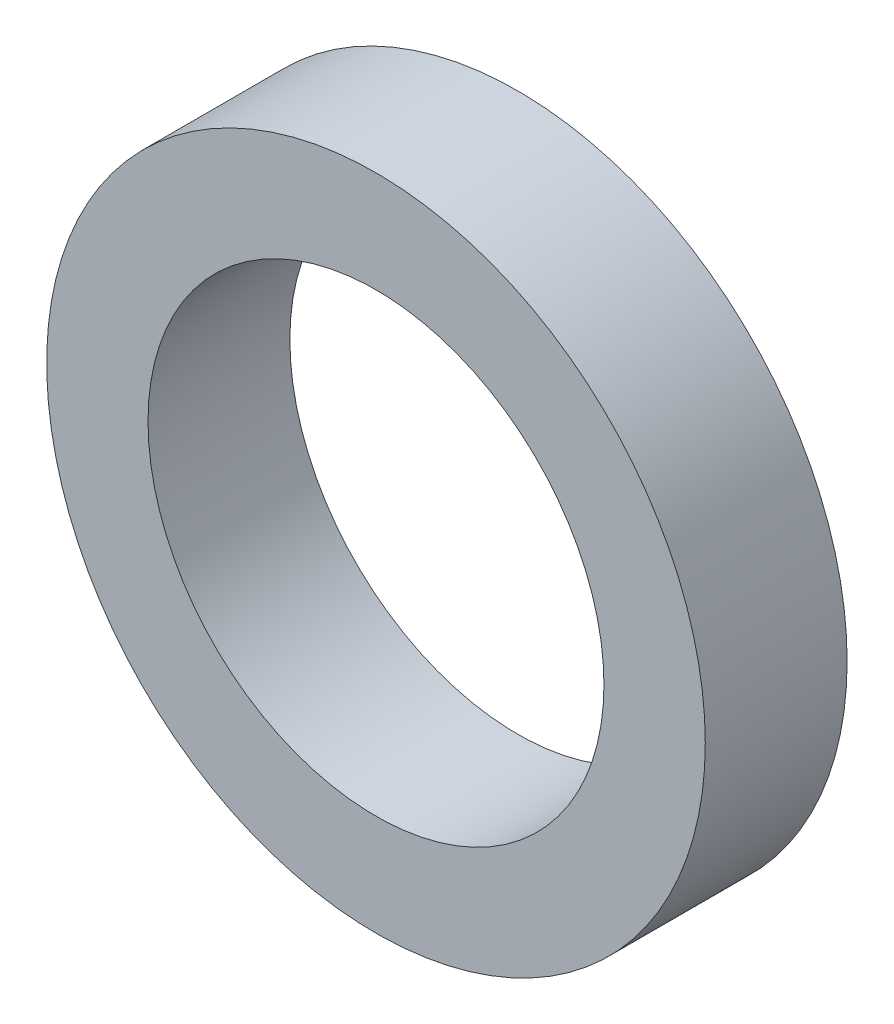
ISO-10303-21;
HEADER;
FILE_DESCRIPTION(('STEP AP214'),'2;1');
FILE_NAME('part.step','',(''),(''),'','','');
FILE_SCHEMA(('AUTOMOTIVE_DESIGN { 1 0 10303 214 1 1 1 1 }'));
ENDSEC;
DATA;
#1=APPLICATION_CONTEXT('core data for automotive mechanical design processes');
#2=APPLICATION_PROTOCOL_DEFINITION('international standard','automotive_design',2000,#1);
#3=PRODUCT_CONTEXT('',#1,'mechanical');
#4=PRODUCT('Part','Part','',(#3));
#5=PRODUCT_RELATED_PRODUCT_CATEGORY('part','',(#4));
#6=PRODUCT_DEFINITION_FORMATION('','',#4);
#7=PRODUCT_DEFINITION_CONTEXT('part definition',#1,'design');
#8=PRODUCT_DEFINITION('design','',#6,#7);
#9=PRODUCT_DEFINITION_SHAPE('','',#8);
#10=(LENGTH_UNIT() NAMED_UNIT(*) SI_UNIT(.MILLI.,.METRE.));
#11=(NAMED_UNIT(*) PLANE_ANGLE_UNIT() SI_UNIT($,.RADIAN.));
#12=(NAMED_UNIT(*) SI_UNIT($,.STERADIAN.) SOLID_ANGLE_UNIT());
#13=UNCERTAINTY_MEASURE_WITH_UNIT(LENGTH_MEASURE(1.E-05),#10,'distance_accuracy_value','');
#14=(GEOMETRIC_REPRESENTATION_CONTEXT(3) GLOBAL_UNCERTAINTY_ASSIGNED_CONTEXT((#13)) GLOBAL_UNIT_ASSIGNED_CONTEXT((#10,
#11,#12)) REPRESENTATION_CONTEXT('',''));
#15=CARTESIAN_POINT('',(0.,0.,0.));
#16=DIRECTION('',(0.,0.,1.));
#17=DIRECTION('',(1.,0.,0.));
#18=AXIS2_PLACEMENT_3D('',#15,#16,#17);
#19=CARTESIAN_POINT('',(0.998101581444755,0.499050790722363,14.));
#20=DIRECTION('',(0.,0.,1.));
#21=DIRECTION('',(1.,0.,0.));
#22=AXIS2_PLACEMENT_3D('',#19,#20,#21);
#23=PLANE('',#22);
#24=CARTESIAN_POINT('',(0.998101581444755,0.499050790722363,14.));
#25=DIRECTION('',(0.,0.,1.));
#26=DIRECTION('',(1.,0.,0.));
#27=AXIS2_PLACEMENT_3D('',#24,#25,#26);
#28=CIRCLE('',#27,32.5);
#29=CARTESIAN_POINT('',(33.4981015814448,0.499050790722363,14.));
#30=VERTEX_POINT('',#29);
#31=EDGE_CURVE('E10',#30,#30,#28,.T.);
#32=ORIENTED_EDGE('',*,*,#31,.T.);
#33=EDGE_LOOP('',(#32));
#34=FACE_BOUND('',#33,.T.);
#35=CARTESIAN_POINT('',(0.998101581444755,0.499050790722363,14.));
#36=DIRECTION('',(0.,0.,1.));
#37=DIRECTION('',(1.,0.,0.));
#38=AXIS2_PLACEMENT_3D('',#35,#36,#37);
#39=CIRCLE('',#38,22.5);
#40=CARTESIAN_POINT('',(23.4981015814448,0.499050790722363,14.));
#41=VERTEX_POINT('',#40);
#42=EDGE_CURVE('E48',#41,#41,#39,.T.);
#43=ORIENTED_EDGE('',*,*,#42,.F.);
#44=EDGE_LOOP('',(#43));
#45=FACE_BOUND('',#44,.T.);
#46=ADVANCED_FACE('F34',(#34,#45),#23,.T.);
#47=CARTESIAN_POINT('',(0.998101581444755,0.499050790722363,0.));
#48=DIRECTION('',(0.,0.,1.));
#49=DIRECTION('',(1.,0.,0.));
#50=AXIS2_PLACEMENT_3D('',#47,#48,#49);
#51=PLANE('',#50);
#52=CARTESIAN_POINT('',(0.998101581444755,0.499050790722363,0.));
#53=DIRECTION('',(0.,0.,1.));
#54=DIRECTION('',(1.,0.,0.));
#55=AXIS2_PLACEMENT_3D('',#52,#53,#54);
#56=CIRCLE('',#55,32.5);
#57=CARTESIAN_POINT('',(33.4981015814448,0.499050790722363,0.));
#58=VERTEX_POINT('',#57);
#59=EDGE_CURVE('E38',#58,#58,#56,.T.);
#60=ORIENTED_EDGE('',*,*,#59,.F.);
#61=EDGE_LOOP('',(#60));
#62=FACE_BOUND('',#61,.T.);
#63=CARTESIAN_POINT('',(0.998101581444755,0.499050790722363,0.));
#64=DIRECTION('',(0.,0.,1.));
#65=DIRECTION('',(1.,0.,0.));
#66=AXIS2_PLACEMENT_3D('',#63,#64,#65);
#67=CIRCLE('',#66,22.5);
#68=CARTESIAN_POINT('',(23.4981015814448,0.499050790722363,0.));
#69=VERTEX_POINT('',#68);
#70=EDGE_CURVE('E50',#69,#69,#67,.T.);
#71=ORIENTED_EDGE('',*,*,#70,.T.);
#72=EDGE_LOOP('',(#71));
#73=FACE_BOUND('',#72,.T.);
#74=ADVANCED_FACE('F63',(#62,#73),#51,.F.);
#75=CARTESIAN_POINT('',(0.998101581444755,0.499050790722363,14.));
#76=DIRECTION('',(0.,0.,-1.));
#77=DIRECTION('',(-1.,0.,0.));
#78=AXIS2_PLACEMENT_3D('',#75,#76,#77);
#79=CYLINDRICAL_SURFACE('',#78,32.5);
#80=ORIENTED_EDGE('',*,*,#31,.F.);
#81=EDGE_LOOP('',(#80));
#82=FACE_BOUND('',#81,.T.);
#83=ORIENTED_EDGE('',*,*,#59,.T.);
#84=EDGE_LOOP('',(#83));
#85=FACE_BOUND('',#84,.T.);
#86=ADVANCED_FACE('F36',(#82,#85),#79,.T.);
#87=CARTESIAN_POINT('',(0.998101581444755,0.499050790722363,14.));
#88=DIRECTION('',(0.,0.,-1.));
#89=DIRECTION('',(-1.,0.,0.));
#90=AXIS2_PLACEMENT_3D('',#87,#88,#89);
#91=CYLINDRICAL_SURFACE('',#90,22.5);
#92=ORIENTED_EDGE('',*,*,#42,.T.);
#93=EDGE_LOOP('',(#92));
#94=FACE_BOUND('',#93,.T.);
#95=ORIENTED_EDGE('',*,*,#70,.F.);
#96=EDGE_LOOP('',(#95));
#97=FACE_BOUND('',#96,.T.);
#98=ADVANCED_FACE('F59',(#94,#97),#91,.F.);
#99=CLOSED_SHELL('',(#46,#74,#86,#98));
#100=MANIFOLD_SOLID_BREP('B2',#99);
#101=ADVANCED_BREP_SHAPE_REPRESENTATION('',(#18,#100),#14);
#102=SHAPE_DEFINITION_REPRESENTATION(#9,#101);
ENDSEC;
END-ISO-10303-21;
